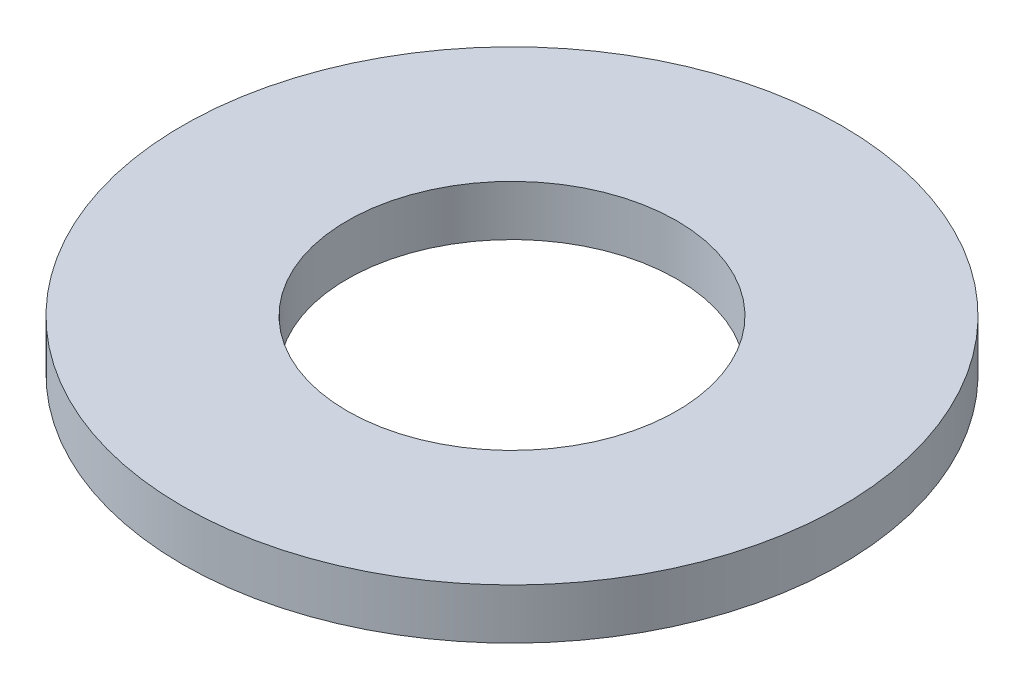
ISO-10303-21;
HEADER;
FILE_DESCRIPTION(('STEP AP214'),'2;1');
FILE_NAME('part.step','',(''),(''),'','','');
FILE_SCHEMA(('AUTOMOTIVE_DESIGN { 1 0 10303 214 1 1 1 1 }'));
ENDSEC;
DATA;
#1=APPLICATION_CONTEXT('core data for automotive mechanical design processes');
#2=APPLICATION_PROTOCOL_DEFINITION('international standard','automotive_design',2000,#1);
#3=PRODUCT_CONTEXT('',#1,'mechanical');
#4=PRODUCT('Part','Part','',(#3));
#5=PRODUCT_RELATED_PRODUCT_CATEGORY('part','',(#4));
#6=PRODUCT_DEFINITION_FORMATION('','',#4);
#7=PRODUCT_DEFINITION_CONTEXT('part definition',#1,'design');
#8=PRODUCT_DEFINITION('design','',#6,#7);
#9=PRODUCT_DEFINITION_SHAPE('','',#8);
#10=(LENGTH_UNIT() NAMED_UNIT(*) SI_UNIT(.MILLI.,.METRE.));
#11=(NAMED_UNIT(*) PLANE_ANGLE_UNIT() SI_UNIT($,.RADIAN.));
#12=(NAMED_UNIT(*) SI_UNIT($,.STERADIAN.) SOLID_ANGLE_UNIT());
#13=UNCERTAINTY_MEASURE_WITH_UNIT(LENGTH_MEASURE(1.E-05),#10,'distance_accuracy_value','');
#14=(GEOMETRIC_REPRESENTATION_CONTEXT(3) GLOBAL_UNCERTAINTY_ASSIGNED_CONTEXT((#13)) GLOBAL_UNIT_ASSIGNED_CONTEXT((#10,
#11,#12)) REPRESENTATION_CONTEXT('',''));
#15=CARTESIAN_POINT('',(0.,0.,0.));
#16=DIRECTION('',(0.,0.,1.));
#17=DIRECTION('',(1.,0.,0.));
#18=AXIS2_PLACEMENT_3D('',#15,#16,#17);
#19=CARTESIAN_POINT('',(0.,13.,0.));
#20=DIRECTION('',(0.,-1.,0.));
#21=DIRECTION('',(0.,0.,-1.));
#22=AXIS2_PLACEMENT_3D('',#19,#20,#21);
#23=CYLINDRICAL_SURFACE('',#22,85.);
#24=CARTESIAN_POINT('',(0.,13.,0.));
#25=DIRECTION('',(0.,1.,0.));
#26=DIRECTION('',(0.,0.,1.));
#27=AXIS2_PLACEMENT_3D('',#24,#25,#26);
#28=CIRCLE('',#27,85.);
#29=CARTESIAN_POINT('',(0.,13.,-85.));
#30=VERTEX_POINT('',#29);
#31=EDGE_CURVE('E10',#30,#30,#28,.T.);
#32=CARTESIAN_POINT('',(0.,0.,0.));
#33=DIRECTION('',(0.,1.,0.));
#34=DIRECTION('',(0.,0.,1.));
#35=AXIS2_PLACEMENT_3D('',#32,#33,#34);
#36=CIRCLE('',#35,85.);
#37=CARTESIAN_POINT('',(0.,0.,-85.));
#38=VERTEX_POINT('',#37);
#39=EDGE_CURVE('E37',#38,#38,#36,.T.);
#40=CARTESIAN_POINT('',(0.,13.,-85.));
#41=CARTESIAN_POINT('',(0.,12.8645833333333,-85.));
#42=CARTESIAN_POINT('',(0.,12.7291666666667,-85.));
#43=CARTESIAN_POINT('',(0.,12.4583333333333,-85.));
#44=CARTESIAN_POINT('',(0.,12.3229166666667,-85.));
#45=CARTESIAN_POINT('',(0.,12.0520833333333,-85.));
#46=CARTESIAN_POINT('',(0.,11.9166666666667,-85.));
#47=CARTESIAN_POINT('',(0.,11.6458333333333,-85.));
#48=CARTESIAN_POINT('',(0.,11.5104166666667,-85.));
#49=CARTESIAN_POINT('',(0.,11.2395833333333,-85.));
#50=CARTESIAN_POINT('',(0.,11.1041666666667,-85.));
#51=CARTESIAN_POINT('',(0.,10.8333333333333,-85.));
#52=CARTESIAN_POINT('',(0.,10.6979166666667,-85.));
#53=CARTESIAN_POINT('',(0.,10.4270833333333,-85.));
#54=CARTESIAN_POINT('',(0.,10.2916666666667,-85.));
#55=CARTESIAN_POINT('',(0.,10.0208333333333,-85.));
#56=CARTESIAN_POINT('',(0.,9.88541666666667,-85.));
#57=CARTESIAN_POINT('',(0.,9.61458333333333,-85.));
#58=CARTESIAN_POINT('',(0.,9.47916666666667,-85.));
#59=CARTESIAN_POINT('',(0.,9.20833333333333,-85.));
#60=CARTESIAN_POINT('',(0.,9.07291666666666,-85.));
#61=CARTESIAN_POINT('',(0.,8.80208333333333,-85.));
#62=CARTESIAN_POINT('',(0.,8.66666666666667,-85.));
#63=CARTESIAN_POINT('',(0.,8.39583333333333,-85.));
#64=CARTESIAN_POINT('',(0.,8.26041666666667,-85.));
#65=CARTESIAN_POINT('',(0.,7.98958333333333,-85.));
#66=CARTESIAN_POINT('',(0.,7.85416666666667,-85.));
#67=CARTESIAN_POINT('',(0.,7.58333333333333,-85.));
#68=CARTESIAN_POINT('',(0.,7.44791666666667,-85.));
#69=CARTESIAN_POINT('',(0.,7.17708333333333,-85.));
#70=CARTESIAN_POINT('',(0.,7.04166666666667,-85.));
#71=CARTESIAN_POINT('',(0.,6.77083333333333,-85.));
#72=CARTESIAN_POINT('',(0.,6.63541666666667,-85.));
#73=CARTESIAN_POINT('',(0.,6.36458333333333,-85.));
#74=CARTESIAN_POINT('',(0.,6.22916666666667,-85.));
#75=CARTESIAN_POINT('',(0.,5.95833333333333,-85.));
#76=CARTESIAN_POINT('',(0.,5.82291666666667,-85.));
#77=CARTESIAN_POINT('',(0.,5.55208333333333,-85.));
#78=CARTESIAN_POINT('',(0.,5.41666666666667,-85.));
#79=CARTESIAN_POINT('',(0.,5.14583333333333,-85.));
#80=CARTESIAN_POINT('',(0.,5.01041666666667,-85.));
#81=CARTESIAN_POINT('',(0.,4.73958333333333,-85.));
#82=CARTESIAN_POINT('',(0.,4.60416666666667,-85.));
#83=CARTESIAN_POINT('',(0.,4.33333333333333,-85.));
#84=CARTESIAN_POINT('',(0.,4.19791666666667,-85.));
#85=CARTESIAN_POINT('',(0.,3.92708333333333,-85.));
#86=CARTESIAN_POINT('',(0.,3.79166666666667,-85.));
#87=CARTESIAN_POINT('',(0.,3.52083333333333,-85.));
#88=CARTESIAN_POINT('',(0.,3.38541666666667,-85.));
#89=CARTESIAN_POINT('',(0.,3.11458333333333,-85.));
#90=CARTESIAN_POINT('',(0.,2.97916666666667,-85.));
#91=CARTESIAN_POINT('',(0.,2.70833333333333,-85.));
#92=CARTESIAN_POINT('',(0.,2.57291666666667,-85.));
#93=CARTESIAN_POINT('',(0.,2.30208333333333,-85.));
#94=CARTESIAN_POINT('',(0.,2.16666666666667,-85.));
#95=CARTESIAN_POINT('',(0.,1.89583333333333,-85.));
#96=CARTESIAN_POINT('',(0.,1.76041666666667,-85.));
#97=CARTESIAN_POINT('',(0.,1.48958333333333,-85.));
#98=CARTESIAN_POINT('',(0.,1.35416666666667,-85.));
#99=CARTESIAN_POINT('',(0.,1.08333333333333,-85.));
#100=CARTESIAN_POINT('',(0.,0.947916666666667,-85.));
#101=CARTESIAN_POINT('',(0.,0.677083333333334,-85.));
#102=CARTESIAN_POINT('',(0.,0.541666666666667,-85.));
#103=CARTESIAN_POINT('',(0.,0.270833333333334,-85.));
#104=CARTESIAN_POINT('',(0.,0.135416666666667,-85.));
#105=CARTESIAN_POINT('',(0.,0.,-85.));
#106=B_SPLINE_CURVE_WITH_KNOTS('',3,(#40,#41,#42,#43,#44,#45,#46,#47,#48,#49,#50,#51,#52,#53,
#54,#55,#56,#57,#58,#59,#60,#61,#62,#63,#64,#65,#66,#67,#68,#69,#70,#71,#72,#73,#74,#75,#76,#77,
#78,#79,#80,#81,#82,#83,#84,#85,#86,#87,#88,#89,#90,#91,#92,#93,#94,#95,#96,#97,#98,#99,#100,
#101,#102,#103,#104,#105),.UNSPECIFIED.,.F.,.F.,(4,2,2,2,2,2,2,2,2,2,2,2,2,2,2,2,2,2,2,2,2,2,2,
2,2,2,2,2,2,2,2,2,4),(0.,0.40625,0.812500000000001,1.21875,1.625,2.03125,2.4375,2.84375,3.25,
3.65625,4.0625,4.46875,4.875,5.28125,5.6875,6.09375,6.5,6.90625,7.3125,7.71875,8.125,8.53125,
8.9375,9.34375,9.75,10.15625,10.5625,10.96875,11.375,11.78125,12.1875,12.59375,13.),.UNSPECIFIED.);
#107=EDGE_CURVE('BSEAM40',#30,#38,#106,.T.);
#108=ORIENTED_EDGE('',*,*,#31,.F.);
#109=ORIENTED_EDGE('',*,*,#39,.T.);
#110=ORIENTED_EDGE('',*,*,#107,.T.);
#111=ORIENTED_EDGE('',*,*,#107,.F.);
#112=EDGE_LOOP('',(#108,#110,#109,#111));
#113=FACE_BOUND('',#112,.T.);
#114=ADVANCED_FACE('F40',(#113),#23,.T.);
#115=CARTESIAN_POINT('',(0.,13.,0.));
#116=DIRECTION('',(0.,1.,0.));
#117=DIRECTION('',(0.,0.,1.));
#118=AXIS2_PLACEMENT_3D('',#115,#116,#117);
#119=PLANE('',#118);
#120=CARTESIAN_POINT('',(0.,13.,0.));
#121=DIRECTION('',(0.,1.,0.));
#122=DIRECTION('',(0.,0.,1.));
#123=AXIS2_PLACEMENT_3D('',#120,#121,#122);
#124=CIRCLE('',#123,42.5);
#125=CARTESIAN_POINT('',(0.,13.,-42.5));
#126=VERTEX_POINT('',#125);
#127=EDGE_CURVE('E50',#126,#126,#124,.T.);
#128=ORIENTED_EDGE('',*,*,#127,.F.);
#129=EDGE_LOOP('',(#128));
#130=FACE_BOUND('',#129,.T.);
#131=ORIENTED_EDGE('',*,*,#31,.T.);
#132=EDGE_LOOP('',(#131));
#133=FACE_BOUND('',#132,.T.);
#134=ADVANCED_FACE('F59',(#130,#133),#119,.T.);
#135=CARTESIAN_POINT('',(0.,0.,0.));
#136=DIRECTION('',(0.,1.,0.));
#137=DIRECTION('',(0.,0.,1.));
#138=AXIS2_PLACEMENT_3D('',#135,#136,#137);
#139=PLANE('',#138);
#140=CARTESIAN_POINT('',(0.,0.,0.));
#141=DIRECTION('',(0.,1.,0.));
#142=DIRECTION('',(0.,0.,1.));
#143=AXIS2_PLACEMENT_3D('',#140,#141,#142);
#144=CIRCLE('',#143,42.5);
#145=CARTESIAN_POINT('',(0.,0.,-42.5));
#146=VERTEX_POINT('',#145);
#147=EDGE_CURVE('E47',#146,#146,#144,.T.);
#148=ORIENTED_EDGE('',*,*,#147,.T.);
#149=EDGE_LOOP('',(#148));
#150=FACE_BOUND('',#149,.T.);
#151=ORIENTED_EDGE('',*,*,#39,.F.);
#152=EDGE_LOOP('',(#151));
#153=FACE_BOUND('',#152,.T.);
#154=ADVANCED_FACE('F58',(#150,#153),#139,.F.);
#155=CARTESIAN_POINT('',(0.,13.,0.));
#156=DIRECTION('',(0.,-1.,0.));
#157=DIRECTION('',(0.,0.,-1.));
#158=AXIS2_PLACEMENT_3D('',#155,#156,#157);
#159=CYLINDRICAL_SURFACE('',#158,42.5);
#160=CARTESIAN_POINT('',(0.,13.,-42.5));
#161=CARTESIAN_POINT('',(0.,12.8645833333333,-42.5));
#162=CARTESIAN_POINT('',(0.,12.7291666666667,-42.5));
#163=CARTESIAN_POINT('',(0.,12.4583333333333,-42.5));
#164=CARTESIAN_POINT('',(0.,12.3229166666667,-42.5));
#165=CARTESIAN_POINT('',(0.,12.0520833333333,-42.5));
#166=CARTESIAN_POINT('',(0.,11.9166666666667,-42.5));
#167=CARTESIAN_POINT('',(0.,11.6458333333333,-42.5));
#168=CARTESIAN_POINT('',(0.,11.5104166666667,-42.5));
#169=CARTESIAN_POINT('',(0.,11.2395833333333,-42.5));
#170=CARTESIAN_POINT('',(0.,11.1041666666667,-42.5));
#171=CARTESIAN_POINT('',(0.,10.8333333333333,-42.5));
#172=CARTESIAN_POINT('',(0.,10.6979166666667,-42.5));
#173=CARTESIAN_POINT('',(0.,10.4270833333333,-42.5));
#174=CARTESIAN_POINT('',(0.,10.2916666666667,-42.5));
#175=CARTESIAN_POINT('',(0.,10.0208333333333,-42.5));
#176=CARTESIAN_POINT('',(0.,9.88541666666667,-42.5));
#177=CARTESIAN_POINT('',(0.,9.61458333333333,-42.5));
#178=CARTESIAN_POINT('',(0.,9.47916666666667,-42.5));
#179=CARTESIAN_POINT('',(0.,9.20833333333333,-42.5));
#180=CARTESIAN_POINT('',(0.,9.07291666666666,-42.5));
#181=CARTESIAN_POINT('',(0.,8.80208333333333,-42.5));
#182=CARTESIAN_POINT('',(0.,8.66666666666667,-42.5));
#183=CARTESIAN_POINT('',(0.,8.39583333333333,-42.5));
#184=CARTESIAN_POINT('',(0.,8.26041666666667,-42.5));
#185=CARTESIAN_POINT('',(0.,7.98958333333333,-42.5));
#186=CARTESIAN_POINT('',(0.,7.85416666666667,-42.5));
#187=CARTESIAN_POINT('',(0.,7.58333333333333,-42.5));
#188=CARTESIAN_POINT('',(0.,7.44791666666667,-42.5));
#189=CARTESIAN_POINT('',(0.,7.17708333333333,-42.5));
#190=CARTESIAN_POINT('',(0.,7.04166666666667,-42.5));
#191=CARTESIAN_POINT('',(0.,6.77083333333333,-42.5));
#192=CARTESIAN_POINT('',(0.,6.63541666666667,-42.5));
#193=CARTESIAN_POINT('',(0.,6.36458333333333,-42.5));
#194=CARTESIAN_POINT('',(0.,6.22916666666667,-42.5));
#195=CARTESIAN_POINT('',(0.,5.95833333333333,-42.5));
#196=CARTESIAN_POINT('',(0.,5.82291666666667,-42.5));
#197=CARTESIAN_POINT('',(0.,5.55208333333333,-42.5));
#198=CARTESIAN_POINT('',(0.,5.41666666666667,-42.5));
#199=CARTESIAN_POINT('',(0.,5.14583333333333,-42.5));
#200=CARTESIAN_POINT('',(0.,5.01041666666667,-42.5));
#201=CARTESIAN_POINT('',(0.,4.73958333333333,-42.5));
#202=CARTESIAN_POINT('',(0.,4.60416666666667,-42.5));
#203=CARTESIAN_POINT('',(0.,4.33333333333333,-42.5));
#204=CARTESIAN_POINT('',(0.,4.19791666666667,-42.5));
#205=CARTESIAN_POINT('',(0.,3.92708333333333,-42.5));
#206=CARTESIAN_POINT('',(0.,3.79166666666667,-42.5));
#207=CARTESIAN_POINT('',(0.,3.52083333333333,-42.5));
#208=CARTESIAN_POINT('',(0.,3.38541666666667,-42.5));
#209=CARTESIAN_POINT('',(0.,3.11458333333333,-42.5));
#210=CARTESIAN_POINT('',(0.,2.97916666666667,-42.5));
#211=CARTESIAN_POINT('',(0.,2.70833333333333,-42.5));
#212=CARTESIAN_POINT('',(0.,2.57291666666667,-42.5));
#213=CARTESIAN_POINT('',(0.,2.30208333333333,-42.5));
#214=CARTESIAN_POINT('',(0.,2.16666666666667,-42.5));
#215=CARTESIAN_POINT('',(0.,1.89583333333333,-42.5));
#216=CARTESIAN_POINT('',(0.,1.76041666666667,-42.5));
#217=CARTESIAN_POINT('',(0.,1.48958333333333,-42.5));
#218=CARTESIAN_POINT('',(0.,1.35416666666667,-42.5));
#219=CARTESIAN_POINT('',(0.,1.08333333333333,-42.5));
#220=CARTESIAN_POINT('',(0.,0.947916666666667,-42.5));
#221=CARTESIAN_POINT('',(0.,0.677083333333334,-42.5));
#222=CARTESIAN_POINT('',(0.,0.541666666666667,-42.5));
#223=CARTESIAN_POINT('',(0.,0.270833333333334,-42.5));
#224=CARTESIAN_POINT('',(0.,0.135416666666667,-42.5));
#225=CARTESIAN_POINT('',(0.,0.,-42.5));
#226=B_SPLINE_CURVE_WITH_KNOTS('',3,(#160,#161,#162,#163,#164,#165,#166,#167,#168,#169,#170,
#171,#172,#173,#174,#175,#176,#177,#178,#179,#180,#181,#182,#183,#184,#185,#186,#187,#188,#189,
#190,#191,#192,#193,#194,#195,#196,#197,#198,#199,#200,#201,#202,#203,#204,#205,#206,#207,#208,
#209,#210,#211,#212,#213,#214,#215,#216,#217,#218,#219,#220,#221,#222,#223,#224,#225),
.UNSPECIFIED.,.F.,.F.,(4,2,2,2,2,2,2,2,2,2,2,2,2,2,2,2,2,2,2,2,2,2,2,2,2,2,2,2,2,2,2,2,4),(0.,
0.40625,0.812500000000001,1.21875,1.625,2.03125,2.4375,2.84375,3.25,3.65625,4.0625,4.46875,
4.875,5.28125,5.6875,6.09375,6.5,6.90625,7.3125,7.71875,8.125,8.53125,8.9375,9.34375,9.75,
10.15625,10.5625,10.96875,11.375,11.78125,12.1875,12.59375,13.),.UNSPECIFIED.);
#227=EDGE_CURVE('BSEAM54',#126,#146,#226,.T.);
#228=ORIENTED_EDGE('',*,*,#127,.T.);
#229=ORIENTED_EDGE('',*,*,#147,.F.);
#230=ORIENTED_EDGE('',*,*,#227,.T.);
#231=ORIENTED_EDGE('',*,*,#227,.F.);
#232=EDGE_LOOP('',(#228,#230,#229,#231));
#233=FACE_BOUND('',#232,.T.);
#234=ADVANCED_FACE('F54',(#233),#159,.F.);
#235=CLOSED_SHELL('',(#114,#134,#154,#234));
#236=MANIFOLD_SOLID_BREP('B2',#235);
#237=ADVANCED_BREP_SHAPE_REPRESENTATION('',(#18,#236),#14);
#238=SHAPE_DEFINITION_REPRESENTATION(#9,#237);
ENDSEC;
END-ISO-10303-21;
